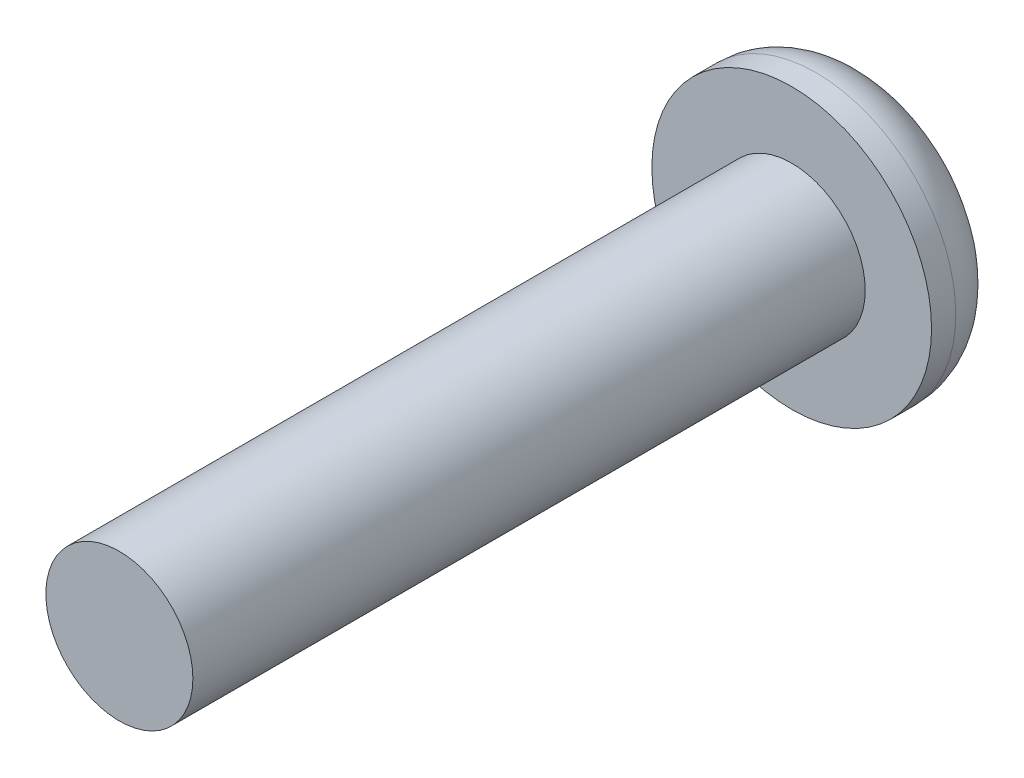
ISO-10303-21;
HEADER;
FILE_DESCRIPTION(('STEP AP214'),'2;1');
FILE_NAME('part.step','',(''),(''),'','','');
FILE_SCHEMA(('AUTOMOTIVE_DESIGN { 1 0 10303 214 1 1 1 1 }'));
ENDSEC;
DATA;
#1=APPLICATION_CONTEXT('core data for automotive mechanical design processes');
#2=APPLICATION_PROTOCOL_DEFINITION('international standard','automotive_design',2000,#1);
#3=PRODUCT_CONTEXT('',#1,'mechanical');
#4=PRODUCT('Part','Part','',(#3));
#5=PRODUCT_RELATED_PRODUCT_CATEGORY('part','',(#4));
#6=PRODUCT_DEFINITION_FORMATION('','',#4);
#7=PRODUCT_DEFINITION_CONTEXT('part definition',#1,'design');
#8=PRODUCT_DEFINITION('design','',#6,#7);
#9=PRODUCT_DEFINITION_SHAPE('','',#8);
#10=(LENGTH_UNIT() NAMED_UNIT(*) SI_UNIT(.MILLI.,.METRE.));
#11=(NAMED_UNIT(*) PLANE_ANGLE_UNIT() SI_UNIT($,.RADIAN.));
#12=(NAMED_UNIT(*) SI_UNIT($,.STERADIAN.) SOLID_ANGLE_UNIT());
#13=UNCERTAINTY_MEASURE_WITH_UNIT(LENGTH_MEASURE(1.E-05),#10,'distance_accuracy_value','');
#14=(GEOMETRIC_REPRESENTATION_CONTEXT(3) GLOBAL_UNCERTAINTY_ASSIGNED_CONTEXT((#13)) GLOBAL_UNIT_ASSIGNED_CONTEXT((#10,
#11,#12)) REPRESENTATION_CONTEXT('',''));
#15=CARTESIAN_POINT('',(0.,0.,0.));
#16=DIRECTION('',(0.,0.,1.));
#17=DIRECTION('',(1.,0.,0.));
#18=AXIS2_PLACEMENT_3D('',#15,#16,#17);
#19=CARTESIAN_POINT('',(0.,0.,2.2098));
#20=DIRECTION('',(0.,0.,1.));
#21=DIRECTION('',(1.,0.,0.));
#22=AXIS2_PLACEMENT_3D('',#19,#20,#21);
#23=PLANE('',#22);
#24=CARTESIAN_POINT('',(0.,0.,2.2098));
#25=DIRECTION('',(0.,0.,1.));
#26=DIRECTION('',(1.,0.,0.));
#27=AXIS2_PLACEMENT_3D('',#24,#25,#26);
#28=CIRCLE('',#27,3.9624);
#29=CARTESIAN_POINT('',(3.9624,0.,2.2098));
#30=VERTEX_POINT('',#29);
#31=EDGE_CURVE('E142',#30,#30,#28,.T.);
#32=ORIENTED_EDGE('',*,*,#31,.T.);
#33=EDGE_LOOP('',(#32));
#34=FACE_BOUND('',#33,.T.);
#35=CARTESIAN_POINT('',(0.,0.,2.2098));
#36=DIRECTION('',(0.,0.,1.));
#37=DIRECTION('',(1.,0.,0.));
#38=AXIS2_PLACEMENT_3D('',#35,#36,#37);
#39=CIRCLE('',#38,2.0828);
#40=CARTESIAN_POINT('',(2.0828,0.,2.2098));
#41=VERTEX_POINT('',#40);
#42=EDGE_CURVE('E133',#41,#41,#39,.T.);
#43=ORIENTED_EDGE('',*,*,#42,.F.);
#44=EDGE_LOOP('',(#43));
#45=FACE_BOUND('',#44,.T.);
#46=ADVANCED_FACE('F31',(#34,#45),#23,.T.);
#47=CARTESIAN_POINT('',(0.,0.,2.2098));
#48=DIRECTION('',(0.,0.,-1.));
#49=DIRECTION('',(-1.,0.,0.));
#50=AXIS2_PLACEMENT_3D('',#47,#48,#49);
#51=CYLINDRICAL_SURFACE('',#50,3.9624);
#52=CARTESIAN_POINT('',(0.,0.,1.524));
#53=DIRECTION('',(0.,0.,1.));
#54=DIRECTION('',(1.,0.,0.));
#55=AXIS2_PLACEMENT_3D('',#52,#53,#54);
#56=CIRCLE('',#55,3.9624);
#57=CARTESIAN_POINT('',(3.9624,0.,1.524));
#58=VERTEX_POINT('',#57);
#59=EDGE_CURVE('E39',#58,#58,#56,.T.);
#60=ORIENTED_EDGE('',*,*,#59,.T.);
#61=EDGE_LOOP('',(#60));
#62=FACE_BOUND('',#61,.T.);
#63=ORIENTED_EDGE('',*,*,#31,.F.);
#64=EDGE_LOOP('',(#63));
#65=FACE_BOUND('',#64,.T.);
#66=ADVANCED_FACE('F149',(#62,#65),#51,.T.);
#67=CARTESIAN_POINT('',(0.,0.,0.));
#68=DIRECTION('',(0.,0.,1.));
#69=DIRECTION('',(1.,0.,0.));
#70=AXIS2_PLACEMENT_3D('',#67,#68,#69);
#71=PLANE('',#70);
#72=DIRECTION('',(0.999833415798117,0.0182521410653723,0.));
#73=VECTOR('',#72,1.);
#74=CARTESIAN_POINT('',(-0.709024608452739,1.17787999902725,0.));
#75=LINE('',#74,#73);
#76=CARTESIAN_POINT('',(-0.709024608452739,1.17787999902725,0.));
#77=VERTEX_POINT('',#76);
#78=CARTESIAN_POINT('',(0.665561697540821,1.20297332234201,0.));
#79=VERTEX_POINT('',#78);
#80=EDGE_CURVE('E120',#77,#79,#75,.T.);
#81=ORIENTED_EDGE('',*,*,#80,.F.);
#82=DIRECTION('',(0.484109890062989,0.875007208166425,0.));
#83=VECTOR('',#82,1.);
#84=CARTESIAN_POINT('',(-1.37458630599356,-0.0250933233147607,0.));
#85=LINE('',#84,#83);
#86=CARTESIAN_POINT('',(-1.37458630599356,-0.0250933233147607,0.));
#87=VERTEX_POINT('',#86);
#88=EDGE_CURVE('E46',#87,#77,#85,.T.);
#89=ORIENTED_EDGE('',*,*,#88,.F.);
#90=DIRECTION('',(-0.515723525735128,0.856755067101052,0.));
#91=VECTOR('',#90,1.);
#92=CARTESIAN_POINT('',(-0.665561697540821,-1.20297332234201,0.));
#93=LINE('',#92,#91);
#94=CARTESIAN_POINT('',(-0.665561697540821,-1.20297332234201,0.));
#95=VERTEX_POINT('',#94);
#96=EDGE_CURVE('E129',#95,#87,#93,.T.);
#97=ORIENTED_EDGE('',*,*,#96,.F.);
#98=DIRECTION('',(-0.999833415798117,-0.0182521410653725,0.));
#99=VECTOR('',#98,1.);
#100=CARTESIAN_POINT('',(0.709024608452739,-1.17787999902725,0.));
#101=LINE('',#100,#99);
#102=CARTESIAN_POINT('',(0.709024608452739,-1.17787999902725,0.));
#103=VERTEX_POINT('',#102);
#104=EDGE_CURVE('E127',#103,#95,#101,.T.);
#105=ORIENTED_EDGE('',*,*,#104,.F.);
#106=DIRECTION('',(-0.484109890062989,-0.875007208166425,0.));
#107=VECTOR('',#106,1.);
#108=CARTESIAN_POINT('',(1.37458630599356,0.0250933233147602,0.));
#109=LINE('',#108,#107);
#110=CARTESIAN_POINT('',(1.37458630599356,0.0250933233147602,0.));
#111=VERTEX_POINT('',#110);
#112=EDGE_CURVE('E94',#111,#103,#109,.T.);
#113=ORIENTED_EDGE('',*,*,#112,.F.);
#114=DIRECTION('',(0.515723525735128,-0.856755067101053,0.));
#115=VECTOR('',#114,1.);
#116=CARTESIAN_POINT('',(0.665561697540821,1.20297332234201,0.));
#117=LINE('',#116,#115);
#118=EDGE_CURVE('E123',#79,#111,#117,.T.);
#119=ORIENTED_EDGE('',*,*,#118,.F.);
#120=EDGE_LOOP('',(#81,#89,#97,#105,#113,#119));
#121=FACE_BOUND('',#120,.T.);
#122=CARTESIAN_POINT('',(0.,0.,0.));
#123=DIRECTION('',(0.,0.,1.));
#124=DIRECTION('',(1.,0.,0.));
#125=AXIS2_PLACEMENT_3D('',#122,#123,#124);
#126=CIRCLE('',#125,2.4384);
#127=CARTESIAN_POINT('',(2.4384,0.,0.));
#128=VERTEX_POINT('',#127);
#129=EDGE_CURVE('E11',#128,#128,#126,.F.);
#130=ORIENTED_EDGE('',*,*,#129,.T.);
#131=EDGE_LOOP('',(#130));
#132=FACE_BOUND('',#131,.T.);
#133=ADVANCED_FACE('F154',(#121,#132),#71,.F.);
#134=CARTESIAN_POINT('',(0.,0.,1.524));
#135=DIRECTION('',(0.,0.,1.));
#136=DIRECTION('',(1.,0.,0.));
#137=AXIS2_PLACEMENT_3D('',#134,#135,#136);
#138=TOROIDAL_SURFACE('',#137,2.4384,1.524);
#139=ORIENTED_EDGE('',*,*,#129,.F.);
#140=EDGE_LOOP('',(#139));
#141=FACE_BOUND('',#140,.T.);
#142=ORIENTED_EDGE('',*,*,#59,.F.);
#143=EDGE_LOOP('',(#142));
#144=FACE_BOUND('',#143,.T.);
#145=ADVANCED_FACE('F33',(#141,#144),#138,.T.);
#146=CARTESIAN_POINT('',(0.,0.,21.2598));
#147=DIRECTION('',(0.,0.,-1.));
#148=DIRECTION('',(-1.,0.,0.));
#149=AXIS2_PLACEMENT_3D('',#146,#147,#148);
#150=CYLINDRICAL_SURFACE('',#149,2.0828);
#151=CARTESIAN_POINT('',(0.,0.,21.2598));
#152=DIRECTION('',(0.,0.,1.));
#153=DIRECTION('',(1.,0.,0.));
#154=AXIS2_PLACEMENT_3D('',#151,#152,#153);
#155=CIRCLE('',#154,2.0828);
#156=CARTESIAN_POINT('',(2.0828,0.,21.2598));
#157=VERTEX_POINT('',#156);
#158=EDGE_CURVE('E139',#157,#157,#155,.T.);
#159=ORIENTED_EDGE('',*,*,#158,.F.);
#160=EDGE_LOOP('',(#159));
#161=FACE_BOUND('',#160,.T.);
#162=ORIENTED_EDGE('',*,*,#42,.T.);
#163=EDGE_LOOP('',(#162));
#164=FACE_BOUND('',#163,.T.);
#165=ADVANCED_FACE('F153',(#161,#164),#150,.T.);
#166=CARTESIAN_POINT('',(0.,0.,21.2598));
#167=DIRECTION('',(0.,0.,1.));
#168=DIRECTION('',(1.,0.,0.));
#169=AXIS2_PLACEMENT_3D('',#166,#167,#168);
#170=PLANE('',#169);
#171=ORIENTED_EDGE('',*,*,#158,.T.);
#172=EDGE_LOOP('',(#171));
#173=FACE_BOUND('',#172,.T.);
#174=ADVANCED_FACE('F160',(#173),#170,.T.);
#175=CARTESIAN_POINT('',(-1.37458630599356,-0.0250933233147607,1.016));
#176=DIRECTION('',(-0.875007208166425,0.484109890062989,0.));
#177=DIRECTION('',(-0.484109890062989,-0.875007208166425,0.));
#178=AXIS2_PLACEMENT_3D('',#175,#176,#177);
#179=PLANE('',#178);
#180=ORIENTED_EDGE('',*,*,#88,.T.);
#181=DIRECTION('',(0.,0.,-1.));
#182=VECTOR('',#181,1.);
#183=CARTESIAN_POINT('',(-0.709024608452739,1.17787999902725,1.016));
#184=LINE('',#183,#182);
#185=CARTESIAN_POINT('',(-0.709024608452739,1.17787999902725,1.016));
#186=VERTEX_POINT('',#185);
#187=EDGE_CURVE('E76',#186,#77,#184,.T.);
#188=ORIENTED_EDGE('',*,*,#187,.F.);
#189=DIRECTION('',(0.484109890062989,0.875007208166425,0.));
#190=VECTOR('',#189,1.);
#191=CARTESIAN_POINT('',(-1.37458630599356,-0.0250933233147607,1.016));
#192=LINE('',#191,#190);
#193=CARTESIAN_POINT('',(-1.37458630599356,-0.0250933233147607,1.016));
#194=VERTEX_POINT('',#193);
#195=EDGE_CURVE('E131',#194,#186,#192,.T.);
#196=ORIENTED_EDGE('',*,*,#195,.F.);
#197=DIRECTION('',(0.,0.,-1.));
#198=VECTOR('',#197,1.);
#199=CARTESIAN_POINT('',(-1.37458630599356,-0.0250933233147607,1.016));
#200=LINE('',#199,#198);
#201=EDGE_CURVE('E54',#194,#87,#200,.T.);
#202=ORIENTED_EDGE('',*,*,#201,.T.);
#203=EDGE_LOOP('',(#180,#188,#196,#202));
#204=FACE_BOUND('',#203,.T.);
#205=ADVANCED_FACE('F176',(#204),#179,.F.);
#206=CARTESIAN_POINT('',(-0.665561697540821,-1.20297332234201,1.016));
#207=DIRECTION('',(-0.856755067101052,-0.515723525735128,0.));
#208=DIRECTION('',(0.515723525735128,-0.856755067101052,0.));
#209=AXIS2_PLACEMENT_3D('',#206,#207,#208);
#210=PLANE('',#209);
#211=ORIENTED_EDGE('',*,*,#96,.T.);
#212=ORIENTED_EDGE('',*,*,#201,.F.);
#213=DIRECTION('',(-0.515723525735128,0.856755067101052,0.));
#214=VECTOR('',#213,1.);
#215=CARTESIAN_POINT('',(-0.665561697540821,-1.20297332234201,1.016));
#216=LINE('',#215,#214);
#217=CARTESIAN_POINT('',(-0.665561697540821,-1.20297332234201,1.016));
#218=VERTEX_POINT('',#217);
#219=EDGE_CURVE('E106',#218,#194,#216,.T.);
#220=ORIENTED_EDGE('',*,*,#219,.F.);
#221=DIRECTION('',(0.,0.,-1.));
#222=VECTOR('',#221,1.);
#223=CARTESIAN_POINT('',(-0.665561697540821,-1.20297332234201,1.016));
#224=LINE('',#223,#222);
#225=EDGE_CURVE('E98',#218,#95,#224,.T.);
#226=ORIENTED_EDGE('',*,*,#225,.T.);
#227=EDGE_LOOP('',(#211,#212,#220,#226));
#228=FACE_BOUND('',#227,.T.);
#229=ADVANCED_FACE('F180',(#228),#210,.F.);
#230=CARTESIAN_POINT('',(0.709024608452739,-1.17787999902725,1.016));
#231=DIRECTION('',(0.0182521410653725,-0.999833415798117,0.));
#232=DIRECTION('',(0.999833415798117,0.0182521410653725,0.));
#233=AXIS2_PLACEMENT_3D('',#230,#231,#232);
#234=PLANE('',#233);
#235=ORIENTED_EDGE('',*,*,#104,.T.);
#236=ORIENTED_EDGE('',*,*,#225,.F.);
#237=DIRECTION('',(-0.999833415798117,-0.0182521410653725,0.));
#238=VECTOR('',#237,1.);
#239=CARTESIAN_POINT('',(0.709024608452739,-1.17787999902725,1.016));
#240=LINE('',#239,#238);
#241=CARTESIAN_POINT('',(0.709024608452739,-1.17787999902725,1.016));
#242=VERTEX_POINT('',#241);
#243=EDGE_CURVE('E102',#242,#218,#240,.T.);
#244=ORIENTED_EDGE('',*,*,#243,.F.);
#245=DIRECTION('',(0.,0.,-1.));
#246=VECTOR('',#245,1.);
#247=CARTESIAN_POINT('',(0.709024608452739,-1.17787999902725,1.016));
#248=LINE('',#247,#246);
#249=EDGE_CURVE('E87',#242,#103,#248,.T.);
#250=ORIENTED_EDGE('',*,*,#249,.T.);
#251=EDGE_LOOP('',(#235,#236,#244,#250));
#252=FACE_BOUND('',#251,.T.);
#253=ADVANCED_FACE('F103',(#252),#234,.F.);
#254=CARTESIAN_POINT('',(1.37458630599356,0.0250933233147602,1.016));
#255=DIRECTION('',(0.875007208166425,-0.484109890062989,0.));
#256=DIRECTION('',(0.484109890062989,0.875007208166425,0.));
#257=AXIS2_PLACEMENT_3D('',#254,#255,#256);
#258=PLANE('',#257);
#259=ORIENTED_EDGE('',*,*,#112,.T.);
#260=ORIENTED_EDGE('',*,*,#249,.F.);
#261=DIRECTION('',(-0.484109890062989,-0.875007208166425,0.));
#262=VECTOR('',#261,1.);
#263=CARTESIAN_POINT('',(1.37458630599356,0.0250933233147602,1.016));
#264=LINE('',#263,#262);
#265=CARTESIAN_POINT('',(1.37458630599356,0.0250933233147602,1.016));
#266=VERTEX_POINT('',#265);
#267=EDGE_CURVE('E91',#266,#242,#264,.T.);
#268=ORIENTED_EDGE('',*,*,#267,.F.);
#269=DIRECTION('',(0.,0.,-1.));
#270=VECTOR('',#269,1.);
#271=CARTESIAN_POINT('',(1.37458630599356,0.0250933233147602,1.016));
#272=LINE('',#271,#270);
#273=EDGE_CURVE('E99',#266,#111,#272,.T.);
#274=ORIENTED_EDGE('',*,*,#273,.T.);
#275=EDGE_LOOP('',(#259,#260,#268,#274));
#276=FACE_BOUND('',#275,.T.);
#277=ADVANCED_FACE('F89',(#276),#258,.F.);
#278=CARTESIAN_POINT('',(0.665561697540821,1.20297332234201,1.016));
#279=DIRECTION('',(0.856755067101053,0.515723525735128,0.));
#280=DIRECTION('',(-0.515723525735128,0.856755067101053,0.));
#281=AXIS2_PLACEMENT_3D('',#278,#279,#280);
#282=PLANE('',#281);
#283=ORIENTED_EDGE('',*,*,#118,.T.);
#284=ORIENTED_EDGE('',*,*,#273,.F.);
#285=DIRECTION('',(0.515723525735128,-0.856755067101053,0.));
#286=VECTOR('',#285,1.);
#287=CARTESIAN_POINT('',(0.665561697540821,1.20297332234201,1.016));
#288=LINE('',#287,#286);
#289=CARTESIAN_POINT('',(0.665561697540821,1.20297332234201,1.016));
#290=VERTEX_POINT('',#289);
#291=EDGE_CURVE('E112',#290,#266,#288,.T.);
#292=ORIENTED_EDGE('',*,*,#291,.F.);
#293=DIRECTION('',(0.,0.,-1.));
#294=VECTOR('',#293,1.);
#295=CARTESIAN_POINT('',(0.665561697540821,1.20297332234201,1.016));
#296=LINE('',#295,#294);
#297=EDGE_CURVE('E136',#290,#79,#296,.T.);
#298=ORIENTED_EDGE('',*,*,#297,.T.);
#299=EDGE_LOOP('',(#283,#284,#292,#298));
#300=FACE_BOUND('',#299,.T.);
#301=ADVANCED_FACE('F184',(#300),#282,.F.);
#302=CARTESIAN_POINT('',(-0.709024608452739,1.17787999902725,1.016));
#303=DIRECTION('',(-0.0182521410653723,0.999833415798117,0.));
#304=DIRECTION('',(-0.999833415798117,-0.0182521410653723,0.));
#305=AXIS2_PLACEMENT_3D('',#302,#303,#304);
#306=PLANE('',#305);
#307=ORIENTED_EDGE('',*,*,#80,.T.);
#308=ORIENTED_EDGE('',*,*,#297,.F.);
#309=DIRECTION('',(0.999833415798117,0.0182521410653723,0.));
#310=VECTOR('',#309,1.);
#311=CARTESIAN_POINT('',(-0.709024608452739,1.17787999902725,1.016));
#312=LINE('',#311,#310);
#313=EDGE_CURVE('E114',#186,#290,#312,.T.);
#314=ORIENTED_EDGE('',*,*,#313,.F.);
#315=ORIENTED_EDGE('',*,*,#187,.T.);
#316=EDGE_LOOP('',(#307,#308,#314,#315));
#317=FACE_BOUND('',#316,.T.);
#318=ADVANCED_FACE('F181',(#317),#306,.F.);
#319=CARTESIAN_POINT('',(-0.709024608452739,1.17787999902725,1.016));
#320=DIRECTION('',(0.,0.,-1.));
#321=DIRECTION('',(-1.,0.,0.));
#322=AXIS2_PLACEMENT_3D('',#319,#320,#321);
#323=PLANE('',#322);
#324=ORIENTED_EDGE('',*,*,#195,.T.);
#325=ORIENTED_EDGE('',*,*,#313,.T.);
#326=ORIENTED_EDGE('',*,*,#291,.T.);
#327=ORIENTED_EDGE('',*,*,#267,.T.);
#328=ORIENTED_EDGE('',*,*,#243,.T.);
#329=ORIENTED_EDGE('',*,*,#219,.T.);
#330=EDGE_LOOP('',(#324,#325,#326,#327,#328,#329));
#331=FACE_BOUND('',#330,.T.);
#332=ADVANCED_FACE('F109',(#331),#323,.T.);
#333=CLOSED_SHELL('',(#46,#66,#133,#145,#165,#174,#205,#229,#253,#277,#301,#318,#332));
#334=MANIFOLD_SOLID_BREP('B2',#333);
#335=ADVANCED_BREP_SHAPE_REPRESENTATION('',(#18,#334),#14);
#336=SHAPE_DEFINITION_REPRESENTATION(#9,#335);
ENDSEC;
END-ISO-10303-21;
